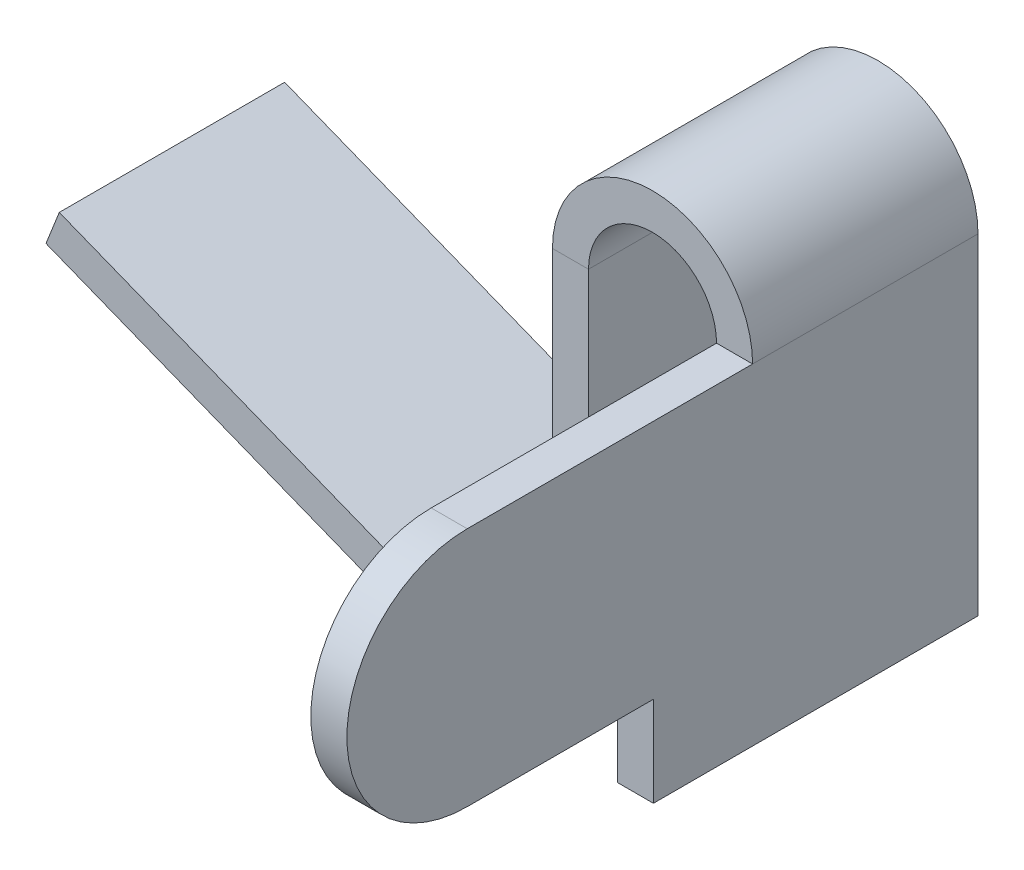
ISO-10303-21;
HEADER;
FILE_DESCRIPTION(('STEP AP214'),'2;1');
FILE_NAME('part.step','',(''),(''),'','','');
FILE_SCHEMA(('AUTOMOTIVE_DESIGN { 1 0 10303 214 1 1 1 1 }'));
ENDSEC;
DATA;
#1=APPLICATION_CONTEXT('core data for automotive mechanical design processes');
#2=APPLICATION_PROTOCOL_DEFINITION('international standard','automotive_design',2000,#1);
#3=PRODUCT_CONTEXT('',#1,'mechanical');
#4=PRODUCT('Part','Part','',(#3));
#5=PRODUCT_RELATED_PRODUCT_CATEGORY('part','',(#4));
#6=PRODUCT_DEFINITION_FORMATION('','',#4);
#7=PRODUCT_DEFINITION_CONTEXT('part definition',#1,'design');
#8=PRODUCT_DEFINITION('design','',#6,#7);
#9=PRODUCT_DEFINITION_SHAPE('','',#8);
#10=(LENGTH_UNIT() NAMED_UNIT(*) SI_UNIT(.MILLI.,.METRE.));
#11=(NAMED_UNIT(*) PLANE_ANGLE_UNIT() SI_UNIT($,.RADIAN.));
#12=(NAMED_UNIT(*) SI_UNIT($,.STERADIAN.) SOLID_ANGLE_UNIT());
#13=UNCERTAINTY_MEASURE_WITH_UNIT(LENGTH_MEASURE(1.E-05),#10,'distance_accuracy_value','');
#14=(GEOMETRIC_REPRESENTATION_CONTEXT(3) GLOBAL_UNCERTAINTY_ASSIGNED_CONTEXT((#13)) GLOBAL_UNIT_ASSIGNED_CONTEXT((#10,
#11,#12)) REPRESENTATION_CONTEXT('',''));
#15=CARTESIAN_POINT('',(0.,0.,0.));
#16=DIRECTION('',(0.,0.,1.));
#17=DIRECTION('',(1.,0.,0.));
#18=AXIS2_PLACEMENT_3D('',#15,#16,#17);
#19=CARTESIAN_POINT('',(0.709999999999978,2.335,5.665));
#20=DIRECTION('',(-1.,0.,0.));
#21=DIRECTION('',(0.,-1.,0.));
#22=AXIS2_PLACEMENT_3D('',#19,#20,#21);
#23=CYLINDRICAL_SURFACE('',#22,1.33499999999999);
#24=DIRECTION('',(1.,0.,0.));
#25=VECTOR('',#24,1.);
#26=CARTESIAN_POINT('',(0.709999999999999,3.66999999999999,5.665));
#27=LINE('',#26,#25);
#28=CARTESIAN_POINT('',(0.71,3.66999999999999,5.665));
#29=VERTEX_POINT('',#28);
#30=CARTESIAN_POINT('',(1.11,3.66999999999998,5.66500000000001));
#31=VERTEX_POINT('',#30);
#32=EDGE_CURVE('E206',#29,#31,#27,.T.);
#33=ORIENTED_EDGE('',*,*,#32,.F.);
#34=CARTESIAN_POINT('',(0.71,2.335,5.665));
#35=DIRECTION('',(-1.,0.,0.));
#36=DIRECTION('',(0.,0.,1.));
#37=AXIS2_PLACEMENT_3D('',#34,#35,#36);
#38=CIRCLE('',#37,1.33499999999999);
#39=CARTESIAN_POINT('',(0.71,1.,5.665));
#40=VERTEX_POINT('',#39);
#41=EDGE_CURVE('E44',#40,#29,#38,.T.);
#42=ORIENTED_EDGE('',*,*,#41,.F.);
#43=DIRECTION('',(1.,0.,0.));
#44=VECTOR('',#43,1.);
#45=CARTESIAN_POINT('',(0.71,1.,5.665));
#46=LINE('',#45,#44);
#47=CARTESIAN_POINT('',(1.11,1.,5.66500000000001));
#48=VERTEX_POINT('',#47);
#49=EDGE_CURVE('E209',#48,#40,#46,.F.);
#50=ORIENTED_EDGE('',*,*,#49,.F.);
#51=CARTESIAN_POINT('',(1.11,2.33499999999999,5.665));
#52=DIRECTION('',(-1.,0.,0.));
#53=DIRECTION('',(0.,0.,1.));
#54=AXIS2_PLACEMENT_3D('',#51,#52,#53);
#55=CIRCLE('',#54,1.33499999999999);
#56=EDGE_CURVE('E11',#31,#48,#55,.F.);
#57=ORIENTED_EDGE('',*,*,#56,.F.);
#58=EDGE_LOOP('',(#33,#42,#50,#57));
#59=FACE_BOUND('',#58,.T.);
#60=ADVANCED_FACE('F37',(#59),#23,.T.);
#61=CARTESIAN_POINT('',(0.71,0.,2.5));
#62=DIRECTION('',(-1.,0.,0.));
#63=DIRECTION('',(0.,0.,1.));
#64=AXIS2_PLACEMENT_3D('',#61,#62,#63);
#65=PLANE('',#64);
#66=DIRECTION('',(0.,0.,-1.));
#67=VECTOR('',#66,1.);
#68=CARTESIAN_POINT('',(0.71,1.,2.5));
#69=LINE('',#68,#67);
#70=CARTESIAN_POINT('',(0.71,1.,3.6));
#71=VERTEX_POINT('',#70);
#72=EDGE_CURVE('E215',#40,#71,#69,.T.);
#73=ORIENTED_EDGE('',*,*,#72,.F.);
#74=ORIENTED_EDGE('',*,*,#41,.T.);
#75=DIRECTION('',(0.,0.,-1.));
#76=VECTOR('',#75,1.);
#77=CARTESIAN_POINT('',(0.71,3.66999999999999,7.));
#78=LINE('',#77,#76);
#79=CARTESIAN_POINT('',(0.71,3.66999999999999,2.5));
#80=VERTEX_POINT('',#79);
#81=EDGE_CURVE('E214',#29,#80,#78,.T.);
#82=ORIENTED_EDGE('',*,*,#81,.T.);
#83=DIRECTION('',(0.,0.,-1.));
#84=VECTOR('',#83,1.);
#85=CARTESIAN_POINT('',(0.71,3.66999999999999,2.5));
#86=LINE('',#85,#84);
#87=CARTESIAN_POINT('',(0.71,3.66999999999999,0.));
#88=VERTEX_POINT('',#87);
#89=EDGE_CURVE('E167',#80,#88,#86,.T.);
#90=ORIENTED_EDGE('',*,*,#89,.T.);
#91=DIRECTION('',(0.,1.,0.));
#92=VECTOR('',#91,1.);
#93=CARTESIAN_POINT('',(0.71,0.,0.));
#94=LINE('',#93,#92);
#95=CARTESIAN_POINT('',(0.71,0.,0.));
#96=VERTEX_POINT('',#95);
#97=EDGE_CURVE('E271',#96,#88,#94,.T.);
#98=ORIENTED_EDGE('',*,*,#97,.F.);
#99=DIRECTION('',(0.,0.,-1.));
#100=VECTOR('',#99,1.);
#101=CARTESIAN_POINT('',(0.71,0.,2.5));
#102=LINE('',#101,#100);
#103=CARTESIAN_POINT('',(0.71,0.,3.6));
#104=VERTEX_POINT('',#103);
#105=EDGE_CURVE('E164',#104,#96,#102,.T.);
#106=ORIENTED_EDGE('',*,*,#105,.F.);
#107=DIRECTION('',(0.,-1.,0.));
#108=VECTOR('',#107,1.);
#109=CARTESIAN_POINT('',(0.71,0.,3.6));
#110=LINE('',#109,#108);
#111=EDGE_CURVE('E147',#71,#104,#110,.T.);
#112=ORIENTED_EDGE('',*,*,#111,.F.);
#113=EDGE_LOOP('',(#73,#74,#82,#90,#98,#106,#112));
#114=FACE_BOUND('',#113,.T.);
#115=ADVANCED_FACE('F212',(#114),#65,.T.);
#116=CARTESIAN_POINT('',(1.11,0.,2.5));
#117=DIRECTION('',(0.,-1.,0.));
#118=DIRECTION('',(0.,0.,-1.));
#119=AXIS2_PLACEMENT_3D('',#116,#117,#118);
#120=PLANE('',#119);
#121=DIRECTION('',(0.,0.,-1.));
#122=VECTOR('',#121,1.);
#123=CARTESIAN_POINT('',(1.11,0.,2.5));
#124=LINE('',#123,#122);
#125=CARTESIAN_POINT('',(1.11,0.,3.6));
#126=VERTEX_POINT('',#125);
#127=CARTESIAN_POINT('',(1.11,0.,0.));
#128=VERTEX_POINT('',#127);
#129=EDGE_CURVE('E155',#126,#128,#124,.T.);
#130=ORIENTED_EDGE('',*,*,#129,.F.);
#131=DIRECTION('',(-1.,0.,0.));
#132=VECTOR('',#131,1.);
#133=CARTESIAN_POINT('',(0.71,0.,3.6));
#134=LINE('',#133,#132);
#135=EDGE_CURVE('E140',#104,#126,#134,.F.);
#136=ORIENTED_EDGE('',*,*,#135,.F.);
#137=ORIENTED_EDGE('',*,*,#105,.T.);
#138=DIRECTION('',(-1.,0.,0.));
#139=VECTOR('',#138,1.);
#140=CARTESIAN_POINT('',(1.11,0.,0.));
#141=LINE('',#140,#139);
#142=EDGE_CURVE('E163',#128,#96,#141,.T.);
#143=ORIENTED_EDGE('',*,*,#142,.F.);
#144=EDGE_LOOP('',(#130,#136,#137,#143));
#145=FACE_BOUND('',#144,.T.);
#146=ADVANCED_FACE('F161',(#145),#120,.T.);
#147=CARTESIAN_POINT('',(1.11,0.,2.5));
#148=DIRECTION('',(-1.,0.,0.));
#149=DIRECTION('',(0.,0.,1.));
#150=AXIS2_PLACEMENT_3D('',#147,#148,#149);
#151=PLANE('',#150);
#152=DIRECTION('',(0.,0.,-1.));
#153=VECTOR('',#152,1.);
#154=CARTESIAN_POINT('',(1.11,3.66999999999998,7.));
#155=LINE('',#154,#153);
#156=CARTESIAN_POINT('',(1.11,3.66999999999998,2.5));
#157=VERTEX_POINT('',#156);
#158=EDGE_CURVE('E220',#31,#157,#155,.T.);
#159=ORIENTED_EDGE('',*,*,#158,.F.);
#160=ORIENTED_EDGE('',*,*,#56,.T.);
#161=DIRECTION('',(0.,0.,1.));
#162=VECTOR('',#161,1.);
#163=CARTESIAN_POINT('',(1.11,1.,2.5));
#164=LINE('',#163,#162);
#165=CARTESIAN_POINT('',(1.11,1.,3.6));
#166=VERTEX_POINT('',#165);
#167=EDGE_CURVE('E158',#48,#166,#164,.F.);
#168=ORIENTED_EDGE('',*,*,#167,.T.);
#169=DIRECTION('',(0.,1.,0.));
#170=VECTOR('',#169,1.);
#171=CARTESIAN_POINT('',(1.11,0.,3.6));
#172=LINE('',#171,#170);
#173=EDGE_CURVE('E144',#166,#126,#172,.F.);
#174=ORIENTED_EDGE('',*,*,#173,.T.);
#175=ORIENTED_EDGE('',*,*,#129,.T.);
#176=DIRECTION('',(0.,1.,0.));
#177=VECTOR('',#176,1.);
#178=CARTESIAN_POINT('',(1.11,0.,0.));
#179=LINE('',#178,#177);
#180=CARTESIAN_POINT('',(1.11,3.66999999999998,0.));
#181=VERTEX_POINT('',#180);
#182=EDGE_CURVE('E275',#128,#181,#179,.T.);
#183=ORIENTED_EDGE('',*,*,#182,.T.);
#184=DIRECTION('',(0.,0.,-1.));
#185=VECTOR('',#184,1.);
#186=CARTESIAN_POINT('',(1.11,3.66999999999998,2.5));
#187=LINE('',#186,#185);
#188=EDGE_CURVE('E165',#157,#181,#187,.T.);
#189=ORIENTED_EDGE('',*,*,#188,.F.);
#190=EDGE_LOOP('',(#159,#160,#168,#174,#175,#183,#189));
#191=FACE_BOUND('',#190,.T.);
#192=ADVANCED_FACE('F153',(#191),#151,.F.);
#193=CARTESIAN_POINT('',(-0.71,3.67,2.5));
#194=DIRECTION('',(0.,0.,1.));
#195=DIRECTION('',(1.,0.,0.));
#196=AXIS2_PLACEMENT_3D('',#193,#194,#195);
#197=PLANE('',#196);
#198=DIRECTION('',(-1.,0.,0.));
#199=VECTOR('',#198,1.);
#200=CARTESIAN_POINT('',(-0.71,3.67,2.5));
#201=LINE('',#200,#199);
#202=CARTESIAN_POINT('',(-0.71,3.67,2.5));
#203=VERTEX_POINT('',#202);
#204=CARTESIAN_POINT('',(-1.11,3.67,2.5));
#205=VERTEX_POINT('',#204);
#206=EDGE_CURVE('E204',#203,#205,#201,.T.);
#207=ORIENTED_EDGE('',*,*,#206,.F.);
#208=CARTESIAN_POINT('',(0.,3.67,2.5));
#209=DIRECTION('',(0.,0.,1.));
#210=DIRECTION('',(1.,0.,0.));
#211=AXIS2_PLACEMENT_3D('',#208,#209,#210);
#212=CIRCLE('',#211,0.71);
#213=EDGE_CURVE('E241',#80,#203,#212,.T.);
#214=ORIENTED_EDGE('',*,*,#213,.F.);
#215=DIRECTION('',(-1.,0.,0.));
#216=VECTOR('',#215,1.);
#217=CARTESIAN_POINT('',(1.11,3.66999999999998,2.5));
#218=LINE('',#217,#216);
#219=EDGE_CURVE('E201',#157,#80,#218,.T.);
#220=ORIENTED_EDGE('',*,*,#219,.F.);
#221=CARTESIAN_POINT('',(0.,3.67,2.5));
#222=DIRECTION('',(0.,0.,1.));
#223=DIRECTION('',(1.,0.,0.));
#224=AXIS2_PLACEMENT_3D('',#221,#222,#223);
#225=CIRCLE('',#224,1.11);
#226=EDGE_CURVE('E244',#157,#205,#225,.T.);
#227=ORIENTED_EDGE('',*,*,#226,.T.);
#228=EDGE_LOOP('',(#207,#214,#220,#227));
#229=FACE_BOUND('',#228,.T.);
#230=ADVANCED_FACE('F339',(#229),#197,.T.);
#231=CARTESIAN_POINT('',(1.11,3.66999999999998,2.5));
#232=DIRECTION('',(0.,0.,1.));
#233=DIRECTION('',(1.,0.,0.));
#234=AXIS2_PLACEMENT_3D('',#231,#232,#233);
#235=PLANE('',#234);
#236=DIRECTION('',(0.,-1.,0.));
#237=VECTOR('',#236,1.);
#238=CARTESIAN_POINT('',(-0.71,3.67,2.5));
#239=LINE('',#238,#237);
#240=CARTESIAN_POINT('',(-0.71,-0.5,2.5));
#241=VERTEX_POINT('',#240);
#242=EDGE_CURVE('E238',#203,#241,#239,.T.);
#243=ORIENTED_EDGE('',*,*,#242,.F.);
#244=ORIENTED_EDGE('',*,*,#206,.T.);
#245=DIRECTION('',(0.,-1.,0.));
#246=VECTOR('',#245,1.);
#247=CARTESIAN_POINT('',(-1.11,3.67,2.5));
#248=LINE('',#247,#246);
#249=CARTESIAN_POINT('',(-1.11,-0.5,2.5));
#250=VERTEX_POINT('',#249);
#251=EDGE_CURVE('E247',#205,#250,#248,.T.);
#252=ORIENTED_EDGE('',*,*,#251,.T.);
#253=DIRECTION('',(1.,0.,0.));
#254=VECTOR('',#253,1.);
#255=CARTESIAN_POINT('',(-1.11,-0.5,2.5));
#256=LINE('',#255,#254);
#257=EDGE_CURVE('E193',#250,#241,#256,.T.);
#258=ORIENTED_EDGE('',*,*,#257,.T.);
#259=EDGE_LOOP('',(#243,#244,#252,#258));
#260=FACE_BOUND('',#259,.T.);
#261=ADVANCED_FACE('F336',(#260),#235,.T.);
#262=CARTESIAN_POINT('',(0.71,3.66999999999999,0.));
#263=DIRECTION('',(0.,0.,-1.));
#264=DIRECTION('',(-1.,0.,0.));
#265=AXIS2_PLACEMENT_3D('',#262,#263,#264);
#266=PLANE('',#265);
#267=DIRECTION('',(1.,0.,0.));
#268=VECTOR('',#267,1.);
#269=CARTESIAN_POINT('',(0.71,3.66999999999999,0.));
#270=LINE('',#269,#268);
#271=EDGE_CURVE('E199',#88,#181,#270,.T.);
#272=ORIENTED_EDGE('',*,*,#271,.F.);
#273=CARTESIAN_POINT('',(0.,3.67,0.));
#274=DIRECTION('',(0.,0.,1.));
#275=DIRECTION('',(1.,0.,0.));
#276=AXIS2_PLACEMENT_3D('',#273,#274,#275);
#277=CIRCLE('',#276,0.71);
#278=CARTESIAN_POINT('',(-0.71,3.67,0.));
#279=VERTEX_POINT('',#278);
#280=EDGE_CURVE('E268',#88,#279,#277,.T.);
#281=ORIENTED_EDGE('',*,*,#280,.T.);
#282=DIRECTION('',(1.,0.,0.));
#283=VECTOR('',#282,1.);
#284=CARTESIAN_POINT('',(-1.11,3.67,0.));
#285=LINE('',#284,#283);
#286=CARTESIAN_POINT('',(-1.11,3.67,0.));
#287=VERTEX_POINT('',#286);
#288=EDGE_CURVE('E197',#287,#279,#285,.T.);
#289=ORIENTED_EDGE('',*,*,#288,.F.);
#290=CARTESIAN_POINT('',(0.,3.67,0.));
#291=DIRECTION('',(0.,0.,1.));
#292=DIRECTION('',(1.,0.,0.));
#293=AXIS2_PLACEMENT_3D('',#290,#291,#292);
#294=CIRCLE('',#293,1.11);
#295=EDGE_CURVE('E277',#181,#287,#294,.T.);
#296=ORIENTED_EDGE('',*,*,#295,.F.);
#297=EDGE_LOOP('',(#272,#281,#289,#296));
#298=FACE_BOUND('',#297,.T.);
#299=ADVANCED_FACE('F344',(#298),#266,.T.);
#300=CARTESIAN_POINT('',(-1.11,3.67,0.));
#301=DIRECTION('',(0.,0.,-1.));
#302=DIRECTION('',(-1.,0.,0.));
#303=AXIS2_PLACEMENT_3D('',#300,#301,#302);
#304=PLANE('',#303);
#305=ORIENTED_EDGE('',*,*,#97,.T.);
#306=ORIENTED_EDGE('',*,*,#271,.T.);
#307=ORIENTED_EDGE('',*,*,#182,.F.);
#308=ORIENTED_EDGE('',*,*,#142,.T.);
#309=EDGE_LOOP('',(#305,#306,#307,#308));
#310=FACE_BOUND('',#309,.T.);
#311=ADVANCED_FACE('F350',(#310),#304,.T.);
#312=CARTESIAN_POINT('',(-1.61274798484912,-1.1137372531073,2.5));
#313=DIRECTION('',(0.,0.,1.));
#314=DIRECTION('',(1.,0.,0.));
#315=AXIS2_PLACEMENT_3D('',#312,#313,#314);
#316=PLANE('',#315);
#317=DIRECTION('',(0.367799977044115,0.929904928950454,0.));
#318=VECTOR('',#317,1.);
#319=CARTESIAN_POINT('',(-1.61274798484912,-1.1137372531073,2.5));
#320=LINE('',#319,#318);
#321=CARTESIAN_POINT('',(-1.61274798484912,-1.1137372531073,2.5));
#322=VERTEX_POINT('',#321);
#323=CARTESIAN_POINT('',(-1.46562799403147,-0.741775281527118,2.5));
#324=VERTEX_POINT('',#323);
#325=EDGE_CURVE('E195',#322,#324,#320,.T.);
#326=ORIENTED_EDGE('',*,*,#325,.F.);
#327=CARTESIAN_POINT('',(-1.37,-0.5,2.5));
#328=DIRECTION('',(0.,0.,-1.));
#329=DIRECTION('',(-1.,0.,0.));
#330=AXIS2_PLACEMENT_3D('',#327,#328,#329);
#331=CIRCLE('',#330,0.66);
#332=EDGE_CURVE('E235',#241,#322,#331,.T.);
#333=ORIENTED_EDGE('',*,*,#332,.F.);
#334=ORIENTED_EDGE('',*,*,#257,.F.);
#335=CARTESIAN_POINT('',(-1.37,-0.5,2.5));
#336=DIRECTION('',(0.,0.,1.));
#337=DIRECTION('',(1.,0.,0.));
#338=AXIS2_PLACEMENT_3D('',#335,#336,#337);
#339=CIRCLE('',#338,0.26);
#340=EDGE_CURVE('E250',#250,#324,#339,.F.);
#341=ORIENTED_EDGE('',*,*,#340,.T.);
#342=EDGE_LOOP('',(#326,#333,#334,#341));
#343=FACE_BOUND('',#342,.T.);
#344=ADVANCED_FACE('F334',(#343),#316,.T.);
#345=CARTESIAN_POINT('',(-1.11,-0.5,2.5));
#346=DIRECTION('',(0.,0.,1.));
#347=DIRECTION('',(1.,0.,0.));
#348=AXIS2_PLACEMENT_3D('',#345,#346,#347);
#349=PLANE('',#348);
#350=DIRECTION('',(-0.929904928950454,0.367799977044115,0.));
#351=VECTOR('',#350,1.);
#352=CARTESIAN_POINT('',(-1.61274798484912,-1.1137372531073,2.5));
#353=LINE('',#352,#351);
#354=CARTESIAN_POINT('',(-6.72722509407661,0.909162620635334,2.5));
#355=VERTEX_POINT('',#354);
#356=EDGE_CURVE('E232',#322,#355,#353,.T.);
#357=ORIENTED_EDGE('',*,*,#356,.F.);
#358=ORIENTED_EDGE('',*,*,#325,.T.);
#359=DIRECTION('',(-0.929904928950454,0.367799977044115,0.));
#360=VECTOR('',#359,1.);
#361=CARTESIAN_POINT('',(-1.46562799403147,-0.741775281527118,2.5));
#362=LINE('',#361,#360);
#363=CARTESIAN_POINT('',(-6.58010510325897,1.28112459221552,2.5));
#364=VERTEX_POINT('',#363);
#365=EDGE_CURVE('E226',#324,#364,#362,.T.);
#366=ORIENTED_EDGE('',*,*,#365,.T.);
#367=DIRECTION('',(0.367799977044113,0.929904928950455,0.));
#368=VECTOR('',#367,1.);
#369=CARTESIAN_POINT('',(-6.72722509407661,0.909162620635334,2.5));
#370=LINE('',#369,#368);
#371=EDGE_CURVE('E228',#355,#364,#370,.T.);
#372=ORIENTED_EDGE('',*,*,#371,.F.);
#373=EDGE_LOOP('',(#357,#358,#366,#372));
#374=FACE_BOUND('',#373,.T.);
#375=ADVANCED_FACE('F332',(#374),#349,.T.);
#376=CARTESIAN_POINT('',(-0.71,-0.5,0.));
#377=DIRECTION('',(0.,0.,-1.));
#378=DIRECTION('',(-1.,0.,0.));
#379=AXIS2_PLACEMENT_3D('',#376,#377,#378);
#380=PLANE('',#379);
#381=DIRECTION('',(-1.,0.,0.));
#382=VECTOR('',#381,1.);
#383=CARTESIAN_POINT('',(-0.71,-0.5,0.));
#384=LINE('',#383,#382);
#385=CARTESIAN_POINT('',(-0.71,-0.5,0.));
#386=VERTEX_POINT('',#385);
#387=CARTESIAN_POINT('',(-1.11,-0.5,0.));
#388=VERTEX_POINT('',#387);
#389=EDGE_CURVE('E191',#386,#388,#384,.T.);
#390=ORIENTED_EDGE('',*,*,#389,.F.);
#391=CARTESIAN_POINT('',(-1.37,-0.5,0.));
#392=DIRECTION('',(0.,0.,-1.));
#393=DIRECTION('',(-1.,0.,0.));
#394=AXIS2_PLACEMENT_3D('',#391,#392,#393);
#395=CIRCLE('',#394,0.66);
#396=CARTESIAN_POINT('',(-1.61274798484912,-1.1137372531073,0.));
#397=VERTEX_POINT('',#396);
#398=EDGE_CURVE('E262',#386,#397,#395,.T.);
#399=ORIENTED_EDGE('',*,*,#398,.T.);
#400=DIRECTION('',(-0.367799977044115,-0.929904928950454,0.));
#401=VECTOR('',#400,1.);
#402=CARTESIAN_POINT('',(-1.46562799403147,-0.741775281527118,0.));
#403=LINE('',#402,#401);
#404=CARTESIAN_POINT('',(-1.46562799403147,-0.741775281527118,0.));
#405=VERTEX_POINT('',#404);
#406=EDGE_CURVE('E189',#405,#397,#403,.T.);
#407=ORIENTED_EDGE('',*,*,#406,.F.);
#408=CARTESIAN_POINT('',(-1.37,-0.5,0.));
#409=DIRECTION('',(0.,0.,1.));
#410=DIRECTION('',(1.,0.,0.));
#411=AXIS2_PLACEMENT_3D('',#408,#409,#410);
#412=CIRCLE('',#411,0.26);
#413=EDGE_CURVE('E229',#388,#405,#412,.F.);
#414=ORIENTED_EDGE('',*,*,#413,.F.);
#415=EDGE_LOOP('',(#390,#399,#407,#414));
#416=FACE_BOUND('',#415,.T.);
#417=ADVANCED_FACE('F303',(#416),#380,.T.);
#418=CARTESIAN_POINT('',(-1.46562799403147,-0.741775281527118,0.));
#419=DIRECTION('',(0.,0.,-1.));
#420=DIRECTION('',(-1.,0.,0.));
#421=AXIS2_PLACEMENT_3D('',#418,#419,#420);
#422=PLANE('',#421);
#423=DIRECTION('',(0.,-1.,0.));
#424=VECTOR('',#423,1.);
#425=CARTESIAN_POINT('',(-0.71,3.67,0.));
#426=LINE('',#425,#424);
#427=EDGE_CURVE('E265',#279,#386,#426,.T.);
#428=ORIENTED_EDGE('',*,*,#427,.T.);
#429=ORIENTED_EDGE('',*,*,#389,.T.);
#430=DIRECTION('',(0.,-1.,0.));
#431=VECTOR('',#430,1.);
#432=CARTESIAN_POINT('',(-1.11,3.67,0.));
#433=LINE('',#432,#431);
#434=EDGE_CURVE('E280',#287,#388,#433,.T.);
#435=ORIENTED_EDGE('',*,*,#434,.F.);
#436=ORIENTED_EDGE('',*,*,#288,.T.);
#437=EDGE_LOOP('',(#428,#429,#435,#436));
#438=FACE_BOUND('',#437,.T.);
#439=ADVANCED_FACE('F299',(#438),#422,.T.);
#440=CARTESIAN_POINT('',(-1.46562799403147,-0.741775281527118,2.5));
#441=DIRECTION('',(-0.367799977044115,-0.929904928950454,0.));
#442=DIRECTION('',(0.929904928950454,-0.367799977044115,0.));
#443=AXIS2_PLACEMENT_3D('',#440,#441,#442);
#444=PLANE('',#443);
#445=DIRECTION('',(-0.929904928950454,0.367799977044115,0.));
#446=VECTOR('',#445,1.);
#447=CARTESIAN_POINT('',(-1.46562799403147,-0.741775281527118,0.));
#448=LINE('',#447,#446);
#449=CARTESIAN_POINT('',(-6.58010510325897,1.28112459221552,0.));
#450=VERTEX_POINT('',#449);
#451=EDGE_CURVE('E222',#405,#450,#448,.T.);
#452=ORIENTED_EDGE('',*,*,#451,.T.);
#453=DIRECTION('',(0.,0.,-1.));
#454=VECTOR('',#453,1.);
#455=CARTESIAN_POINT('',(-6.58010510325897,1.28112459221552,2.5));
#456=LINE('',#455,#454);
#457=EDGE_CURVE('E187',#364,#450,#456,.T.);
#458=ORIENTED_EDGE('',*,*,#457,.F.);
#459=ORIENTED_EDGE('',*,*,#365,.F.);
#460=DIRECTION('',(0.,0.,-1.));
#461=VECTOR('',#460,1.);
#462=CARTESIAN_POINT('',(-1.46562799403147,-0.741775281527118,2.5));
#463=LINE('',#462,#461);
#464=EDGE_CURVE('E253',#324,#405,#463,.T.);
#465=ORIENTED_EDGE('',*,*,#464,.T.);
#466=EDGE_LOOP('',(#452,#458,#459,#465));
#467=FACE_BOUND('',#466,.T.);
#468=ADVANCED_FACE('F328',(#467),#444,.F.);
#469=CARTESIAN_POINT('',(-6.72722509407661,0.909162620635334,2.5));
#470=DIRECTION('',(-0.929904928950455,0.367799977044113,0.));
#471=DIRECTION('',(-0.367799977044113,-0.929904928950455,0.));
#472=AXIS2_PLACEMENT_3D('',#469,#470,#471);
#473=PLANE('',#472);
#474=DIRECTION('',(0.367799977044113,0.929904928950455,0.));
#475=VECTOR('',#474,1.);
#476=CARTESIAN_POINT('',(-6.72722509407661,0.909162620635334,0.));
#477=LINE('',#476,#475);
#478=CARTESIAN_POINT('',(-6.72722509407661,0.909162620635334,0.));
#479=VERTEX_POINT('',#478);
#480=EDGE_CURVE('E256',#479,#450,#477,.T.);
#481=ORIENTED_EDGE('',*,*,#480,.F.);
#482=DIRECTION('',(0.,0.,-1.));
#483=VECTOR('',#482,1.);
#484=CARTESIAN_POINT('',(-6.72722509407661,0.909162620635334,2.5));
#485=LINE('',#484,#483);
#486=EDGE_CURVE('E185',#355,#479,#485,.T.);
#487=ORIENTED_EDGE('',*,*,#486,.F.);
#488=ORIENTED_EDGE('',*,*,#371,.T.);
#489=ORIENTED_EDGE('',*,*,#457,.T.);
#490=EDGE_LOOP('',(#481,#487,#488,#489));
#491=FACE_BOUND('',#490,.T.);
#492=ADVANCED_FACE('F382',(#491),#473,.T.);
#493=CARTESIAN_POINT('',(-1.61274798484912,-1.1137372531073,2.5));
#494=DIRECTION('',(-0.367799977044115,-0.929904928950454,0.));
#495=DIRECTION('',(0.929904928950454,-0.367799977044115,0.));
#496=AXIS2_PLACEMENT_3D('',#493,#494,#495);
#497=PLANE('',#496);
#498=DIRECTION('',(-0.929904928950454,0.367799977044115,0.));
#499=VECTOR('',#498,1.);
#500=CARTESIAN_POINT('',(-1.61274798484912,-1.1137372531073,0.));
#501=LINE('',#500,#499);
#502=EDGE_CURVE('E259',#397,#479,#501,.T.);
#503=ORIENTED_EDGE('',*,*,#502,.F.);
#504=DIRECTION('',(0.,0.,-1.));
#505=VECTOR('',#504,1.);
#506=CARTESIAN_POINT('',(-1.61274798484912,-1.1137372531073,2.5));
#507=LINE('',#506,#505);
#508=EDGE_CURVE('E182',#322,#397,#507,.T.);
#509=ORIENTED_EDGE('',*,*,#508,.F.);
#510=ORIENTED_EDGE('',*,*,#356,.T.);
#511=ORIENTED_EDGE('',*,*,#486,.T.);
#512=EDGE_LOOP('',(#503,#509,#510,#511));
#513=FACE_BOUND('',#512,.T.);
#514=ADVANCED_FACE('F317',(#513),#497,.T.);
#515=CARTESIAN_POINT('',(-1.37,-0.5,2.5));
#516=DIRECTION('',(0.,0.,-1.));
#517=DIRECTION('',(-1.,0.,0.));
#518=AXIS2_PLACEMENT_3D('',#515,#516,#517);
#519=CYLINDRICAL_SURFACE('',#518,0.66);
#520=ORIENTED_EDGE('',*,*,#398,.F.);
#521=DIRECTION('',(0.,0.,-1.));
#522=VECTOR('',#521,1.);
#523=CARTESIAN_POINT('',(-0.71,-0.5,2.5));
#524=LINE('',#523,#522);
#525=EDGE_CURVE('E179',#241,#386,#524,.T.);
#526=ORIENTED_EDGE('',*,*,#525,.F.);
#527=ORIENTED_EDGE('',*,*,#332,.T.);
#528=ORIENTED_EDGE('',*,*,#508,.T.);
#529=EDGE_LOOP('',(#520,#526,#527,#528));
#530=FACE_BOUND('',#529,.T.);
#531=ADVANCED_FACE('F312',(#530),#519,.T.);
#532=CARTESIAN_POINT('',(-0.71,3.67,2.5));
#533=DIRECTION('',(1.,0.,0.));
#534=DIRECTION('',(0.,1.,0.));
#535=AXIS2_PLACEMENT_3D('',#532,#533,#534);
#536=PLANE('',#535);
#537=ORIENTED_EDGE('',*,*,#427,.F.);
#538=DIRECTION('',(0.,0.,-1.));
#539=VECTOR('',#538,1.);
#540=CARTESIAN_POINT('',(-0.71,3.67,2.5));
#541=LINE('',#540,#539);
#542=EDGE_CURVE('E176',#203,#279,#541,.T.);
#543=ORIENTED_EDGE('',*,*,#542,.F.);
#544=ORIENTED_EDGE('',*,*,#242,.T.);
#545=ORIENTED_EDGE('',*,*,#525,.T.);
#546=EDGE_LOOP('',(#537,#543,#544,#545));
#547=FACE_BOUND('',#546,.T.);
#548=ADVANCED_FACE('F307',(#547),#536,.T.);
#549=CARTESIAN_POINT('',(0.,3.67,2.5));
#550=DIRECTION('',(0.,0.,-1.));
#551=DIRECTION('',(-1.,0.,0.));
#552=AXIS2_PLACEMENT_3D('',#549,#550,#551);
#553=CYLINDRICAL_SURFACE('',#552,0.71);
#554=ORIENTED_EDGE('',*,*,#280,.F.);
#555=ORIENTED_EDGE('',*,*,#89,.F.);
#556=ORIENTED_EDGE('',*,*,#213,.T.);
#557=ORIENTED_EDGE('',*,*,#542,.T.);
#558=EDGE_LOOP('',(#554,#555,#556,#557));
#559=FACE_BOUND('',#558,.T.);
#560=ADVANCED_FACE('F347',(#559),#553,.F.);
#561=CARTESIAN_POINT('',(0.,3.67,2.5));
#562=DIRECTION('',(0.,0.,-1.));
#563=DIRECTION('',(-1.,0.,0.));
#564=AXIS2_PLACEMENT_3D('',#561,#562,#563);
#565=CYLINDRICAL_SURFACE('',#564,1.11);
#566=ORIENTED_EDGE('',*,*,#295,.T.);
#567=DIRECTION('',(0.,0.,-1.));
#568=VECTOR('',#567,1.);
#569=CARTESIAN_POINT('',(-1.11,3.67,2.5));
#570=LINE('',#569,#568);
#571=EDGE_CURVE('E170',#205,#287,#570,.T.);
#572=ORIENTED_EDGE('',*,*,#571,.F.);
#573=ORIENTED_EDGE('',*,*,#226,.F.);
#574=ORIENTED_EDGE('',*,*,#188,.T.);
#575=EDGE_LOOP('',(#566,#572,#573,#574));
#576=FACE_BOUND('',#575,.T.);
#577=ADVANCED_FACE('F341',(#576),#565,.T.);
#578=CARTESIAN_POINT('',(-1.11,3.67,2.5));
#579=DIRECTION('',(1.,0.,0.));
#580=DIRECTION('',(0.,1.,0.));
#581=AXIS2_PLACEMENT_3D('',#578,#579,#580);
#582=PLANE('',#581);
#583=ORIENTED_EDGE('',*,*,#434,.T.);
#584=DIRECTION('',(0.,0.,-1.));
#585=VECTOR('',#584,1.);
#586=CARTESIAN_POINT('',(-1.11,-0.5,2.5));
#587=LINE('',#586,#585);
#588=EDGE_CURVE('E287',#250,#388,#587,.T.);
#589=ORIENTED_EDGE('',*,*,#588,.F.);
#590=ORIENTED_EDGE('',*,*,#251,.F.);
#591=ORIENTED_EDGE('',*,*,#571,.T.);
#592=EDGE_LOOP('',(#583,#589,#590,#591));
#593=FACE_BOUND('',#592,.T.);
#594=ADVANCED_FACE('F294',(#593),#582,.F.);
#595=CARTESIAN_POINT('',(-1.37,-0.5,2.5));
#596=DIRECTION('',(0.,0.,-1.));
#597=DIRECTION('',(-1.,0.,0.));
#598=AXIS2_PLACEMENT_3D('',#595,#596,#597);
#599=CYLINDRICAL_SURFACE('',#598,0.26);
#600=ORIENTED_EDGE('',*,*,#413,.T.);
#601=ORIENTED_EDGE('',*,*,#464,.F.);
#602=ORIENTED_EDGE('',*,*,#340,.F.);
#603=ORIENTED_EDGE('',*,*,#588,.T.);
#604=EDGE_LOOP('',(#600,#601,#602,#603));
#605=FACE_BOUND('',#604,.T.);
#606=ADVANCED_FACE('F324',(#605),#599,.F.);
#607=CARTESIAN_POINT('',(-1.37,-0.5,0.));
#608=DIRECTION('',(0.,0.,-1.));
#609=DIRECTION('',(-1.,0.,0.));
#610=AXIS2_PLACEMENT_3D('',#607,#608,#609);
#611=PLANE('',#610);
#612=ORIENTED_EDGE('',*,*,#451,.F.);
#613=ORIENTED_EDGE('',*,*,#406,.T.);
#614=ORIENTED_EDGE('',*,*,#502,.T.);
#615=ORIENTED_EDGE('',*,*,#480,.T.);
#616=EDGE_LOOP('',(#612,#613,#614,#615));
#617=FACE_BOUND('',#616,.T.);
#618=ADVANCED_FACE('F321',(#617),#611,.T.);
#619=CARTESIAN_POINT('',(1.11,3.66999999999998,7.));
#620=DIRECTION('',(0.,-1.,0.));
#621=DIRECTION('',(1.,0.,0.));
#622=AXIS2_PLACEMENT_3D('',#619,#620,#621);
#623=PLANE('',#622);
#624=ORIENTED_EDGE('',*,*,#81,.F.);
#625=ORIENTED_EDGE('',*,*,#32,.T.);
#626=ORIENTED_EDGE('',*,*,#158,.T.);
#627=ORIENTED_EDGE('',*,*,#219,.T.);
#628=EDGE_LOOP('',(#624,#625,#626,#627));
#629=FACE_BOUND('',#628,.T.);
#630=ADVANCED_FACE('F217',(#629),#623,.F.);
#631=CARTESIAN_POINT('',(0.71,0.,3.6));
#632=DIRECTION('',(0.,0.,-1.));
#633=DIRECTION('',(0.,-1.,0.));
#634=AXIS2_PLACEMENT_3D('',#631,#632,#633);
#635=PLANE('',#634);
#636=DIRECTION('',(-1.,0.,0.));
#637=VECTOR('',#636,1.);
#638=CARTESIAN_POINT('',(0.71,1.,3.6));
#639=LINE('',#638,#637);
#640=EDGE_CURVE('E151',#71,#166,#639,.F.);
#641=ORIENTED_EDGE('',*,*,#640,.F.);
#642=ORIENTED_EDGE('',*,*,#111,.T.);
#643=ORIENTED_EDGE('',*,*,#135,.T.);
#644=ORIENTED_EDGE('',*,*,#173,.F.);
#645=EDGE_LOOP('',(#641,#642,#643,#644));
#646=FACE_BOUND('',#645,.T.);
#647=ADVANCED_FACE('F143',(#646),#635,.F.);
#648=CARTESIAN_POINT('',(0.71,1.,2.5));
#649=DIRECTION('',(0.,1.,0.));
#650=DIRECTION('',(0.,0.,-1.));
#651=AXIS2_PLACEMENT_3D('',#648,#649,#650);
#652=PLANE('',#651);
#653=ORIENTED_EDGE('',*,*,#167,.F.);
#654=ORIENTED_EDGE('',*,*,#49,.T.);
#655=ORIENTED_EDGE('',*,*,#72,.T.);
#656=ORIENTED_EDGE('',*,*,#640,.T.);
#657=EDGE_LOOP('',(#653,#654,#655,#656));
#658=FACE_BOUND('',#657,.T.);
#659=ADVANCED_FACE('F355',(#658),#652,.F.);
#660=CLOSED_SHELL('',(#60,#115,#146,#192,#230,#261,#299,#311,#344,#375,#417,#439,#468,#492,#514,
#531,#548,#560,#577,#594,#606,#618,#630,#647,#659));
#661=MANIFOLD_SOLID_BREP('B2',#660);
#662=ADVANCED_BREP_SHAPE_REPRESENTATION('',(#18,#661),#14);
#663=SHAPE_DEFINITION_REPRESENTATION(#9,#662);
ENDSEC;
END-ISO-10303-21;
